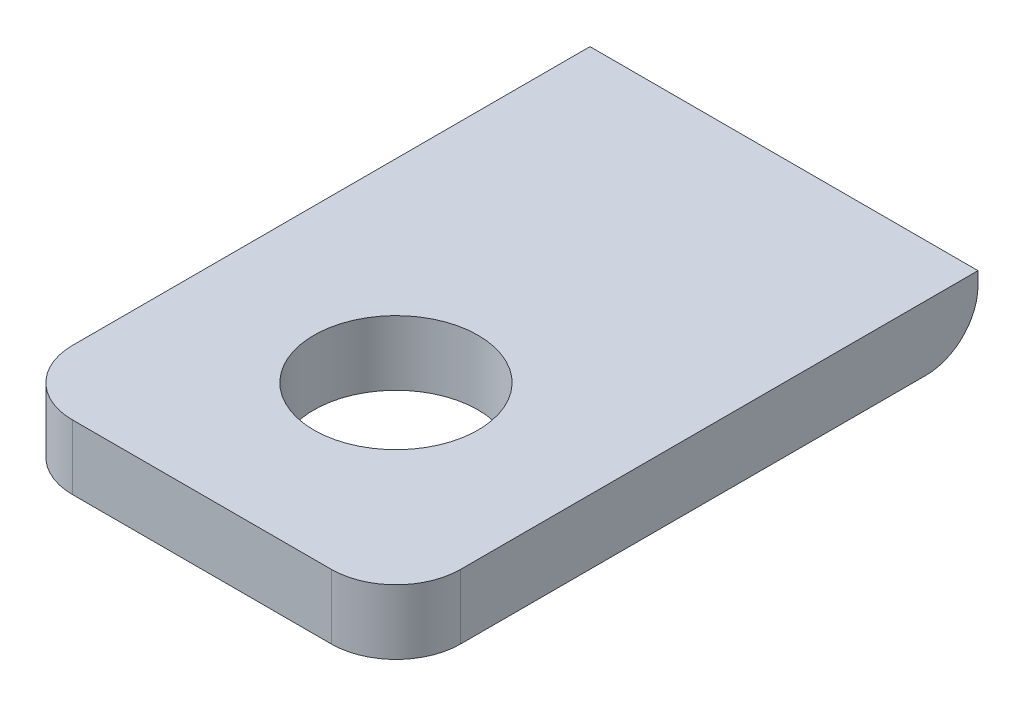
ISO-10303-21;
HEADER;
FILE_DESCRIPTION(('STEP AP214'),'2;1');
FILE_NAME('part.step','',(''),(''),'','','');
FILE_SCHEMA(('AUTOMOTIVE_DESIGN { 1 0 10303 214 1 1 1 1 }'));
ENDSEC;
DATA;
#1=APPLICATION_CONTEXT('core data for automotive mechanical design processes');
#2=APPLICATION_PROTOCOL_DEFINITION('international standard','automotive_design',2000,#1);
#3=PRODUCT_CONTEXT('',#1,'mechanical');
#4=PRODUCT('Part','Part','',(#3));
#5=PRODUCT_RELATED_PRODUCT_CATEGORY('part','',(#4));
#6=PRODUCT_DEFINITION_FORMATION('','',#4);
#7=PRODUCT_DEFINITION_CONTEXT('part definition',#1,'design');
#8=PRODUCT_DEFINITION('design','',#6,#7);
#9=PRODUCT_DEFINITION_SHAPE('','',#8);
#10=(LENGTH_UNIT() NAMED_UNIT(*) SI_UNIT(.MILLI.,.METRE.));
#11=(NAMED_UNIT(*) PLANE_ANGLE_UNIT() SI_UNIT($,.RADIAN.));
#12=(NAMED_UNIT(*) SI_UNIT($,.STERADIAN.) SOLID_ANGLE_UNIT());
#13=UNCERTAINTY_MEASURE_WITH_UNIT(LENGTH_MEASURE(1.E-05),#10,'distance_accuracy_value','');
#14=(GEOMETRIC_REPRESENTATION_CONTEXT(3) GLOBAL_UNCERTAINTY_ASSIGNED_CONTEXT((#13)) GLOBAL_UNIT_ASSIGNED_CONTEXT((#10,
#11,#12)) REPRESENTATION_CONTEXT('',''));
#15=CARTESIAN_POINT('',(0.,0.,0.));
#16=DIRECTION('',(0.,0.,1.));
#17=DIRECTION('',(1.,0.,0.));
#18=AXIS2_PLACEMENT_3D('',#15,#16,#17);
#19=CARTESIAN_POINT('',(8.55,0.1,3.95));
#20=DIRECTION('',(-1.,0.,0.));
#21=DIRECTION('',(0.,0.,1.));
#22=AXIS2_PLACEMENT_3D('',#19,#20,#21);
#23=CYLINDRICAL_SURFACE('',#22,0.2);
#24=CARTESIAN_POINT('',(10.05,0.1,3.95));
#25=DIRECTION('',(-1.,0.,0.));
#26=DIRECTION('',(0.,0.,1.));
#27=AXIS2_PLACEMENT_3D('',#24,#25,#26);
#28=CIRCLE('',#27,0.2);
#29=CARTESIAN_POINT('',(10.05,0.1,3.75));
#30=VERTEX_POINT('',#29);
#31=CARTESIAN_POINT('',(10.05,-0.1,3.95));
#32=VERTEX_POINT('',#31);
#33=EDGE_CURVE('E79',#30,#32,#28,.T.);
#34=ORIENTED_EDGE('',*,*,#33,.T.);
#35=DIRECTION('',(1.,0.,0.));
#36=VECTOR('',#35,1.);
#37=CARTESIAN_POINT('',(8.55,-0.1,3.95));
#38=LINE('',#37,#36);
#39=CARTESIAN_POINT('',(8.55,-0.1,3.95));
#40=VERTEX_POINT('',#39);
#41=EDGE_CURVE('E77',#40,#32,#38,.T.);
#42=ORIENTED_EDGE('',*,*,#41,.F.);
#43=CARTESIAN_POINT('',(8.55,0.1,3.95));
#44=DIRECTION('',(-1.,0.,0.));
#45=DIRECTION('',(0.,0.,1.));
#46=AXIS2_PLACEMENT_3D('',#43,#44,#45);
#47=CIRCLE('',#46,0.2);
#48=CARTESIAN_POINT('',(8.55,0.1,3.75));
#49=VERTEX_POINT('',#48);
#50=EDGE_CURVE('E21',#40,#49,#47,.F.);
#51=ORIENTED_EDGE('',*,*,#50,.T.);
#52=DIRECTION('',(-1.,0.,0.));
#53=VECTOR('',#52,1.);
#54=CARTESIAN_POINT('',(10.05,0.1,3.75));
#55=LINE('',#54,#53);
#56=EDGE_CURVE('E74',#30,#49,#55,.T.);
#57=ORIENTED_EDGE('',*,*,#56,.F.);
#58=EDGE_LOOP('',(#34,#42,#51,#57));
#59=FACE_BOUND('',#58,.T.);
#60=ADVANCED_FACE('F18',(#59),#23,.T.);
#61=CARTESIAN_POINT('',(8.55,-0.1,6.));
#62=DIRECTION('',(0.,-1.,0.));
#63=DIRECTION('',(0.,0.,-1.));
#64=AXIS2_PLACEMENT_3D('',#61,#62,#63);
#65=PLANE('',#64);
#66=CARTESIAN_POINT('',(9.3,-0.1,5.25));
#67=DIRECTION('',(0.,1.,0.));
#68=DIRECTION('',(0.,0.,1.));
#69=AXIS2_PLACEMENT_3D('',#66,#67,#68);
#70=CIRCLE('',#69,0.317499999999999);
#71=CARTESIAN_POINT('',(9.3,-0.1,5.5675));
#72=VERTEX_POINT('',#71);
#73=EDGE_CURVE('E101',#72,#72,#70,.T.);
#74=ORIENTED_EDGE('',*,*,#73,.T.);
#75=EDGE_LOOP('',(#74));
#76=FACE_BOUND('',#75,.T.);
#77=DIRECTION('',(1.,0.,0.));
#78=VECTOR('',#77,1.);
#79=CARTESIAN_POINT('',(10.05,-0.1,6.));
#80=LINE('',#79,#78);
#81=CARTESIAN_POINT('',(8.8,-0.1,6.));
#82=VERTEX_POINT('',#81);
#83=CARTESIAN_POINT('',(9.8,-0.1,6.));
#84=VERTEX_POINT('',#83);
#85=EDGE_CURVE('E109',#82,#84,#80,.T.);
#86=ORIENTED_EDGE('',*,*,#85,.F.);
#87=CARTESIAN_POINT('',(8.8,-0.1,5.75));
#88=DIRECTION('',(0.,1.,0.));
#89=DIRECTION('',(0.,0.,1.));
#90=AXIS2_PLACEMENT_3D('',#87,#88,#89);
#91=CIRCLE('',#90,0.25);
#92=CARTESIAN_POINT('',(8.55,-0.1,5.75));
#93=VERTEX_POINT('',#92);
#94=EDGE_CURVE('E94',#93,#82,#91,.T.);
#95=ORIENTED_EDGE('',*,*,#94,.F.);
#96=DIRECTION('',(0.,0.,1.));
#97=VECTOR('',#96,1.);
#98=CARTESIAN_POINT('',(8.55,-0.1,6.));
#99=LINE('',#98,#97);
#100=EDGE_CURVE('E90',#40,#93,#99,.T.);
#101=ORIENTED_EDGE('',*,*,#100,.F.);
#102=ORIENTED_EDGE('',*,*,#41,.T.);
#103=DIRECTION('',(0.,0.,-1.));
#104=VECTOR('',#103,1.);
#105=CARTESIAN_POINT('',(10.05,-0.1,3.75));
#106=LINE('',#105,#104);
#107=CARTESIAN_POINT('',(10.05,-0.1,5.75));
#108=VERTEX_POINT('',#107);
#109=EDGE_CURVE('E87',#108,#32,#106,.T.);
#110=ORIENTED_EDGE('',*,*,#109,.F.);
#111=CARTESIAN_POINT('',(9.8,-0.1,5.75));
#112=DIRECTION('',(0.,1.,0.));
#113=DIRECTION('',(0.,0.,1.));
#114=AXIS2_PLACEMENT_3D('',#111,#112,#113);
#115=CIRCLE('',#114,0.25);
#116=EDGE_CURVE('E112',#84,#108,#115,.T.);
#117=ORIENTED_EDGE('',*,*,#116,.F.);
#118=EDGE_LOOP('',(#86,#95,#101,#102,#110,#117));
#119=FACE_BOUND('',#118,.T.);
#120=ADVANCED_FACE('F134',(#76,#119),#65,.T.);
#121=CARTESIAN_POINT('',(10.05,0.15,3.75));
#122=DIRECTION('',(0.,0.,-1.));
#123=DIRECTION('',(-1.,0.,0.));
#124=AXIS2_PLACEMENT_3D('',#121,#122,#123);
#125=PLANE('',#124);
#126=DIRECTION('',(0.,1.,0.));
#127=VECTOR('',#126,1.);
#128=CARTESIAN_POINT('',(8.55,0.15,3.75));
#129=LINE('',#128,#127);
#130=CARTESIAN_POINT('',(8.55,0.15,3.75));
#131=VERTEX_POINT('',#130);
#132=EDGE_CURVE('E84',#131,#49,#129,.F.);
#133=ORIENTED_EDGE('',*,*,#132,.F.);
#134=DIRECTION('',(1.,0.,0.));
#135=VECTOR('',#134,1.);
#136=CARTESIAN_POINT('',(8.55,0.15,3.75));
#137=LINE('',#136,#135);
#138=CARTESIAN_POINT('',(10.05,0.15,3.75));
#139=VERTEX_POINT('',#138);
#140=EDGE_CURVE('E102',#131,#139,#137,.T.);
#141=ORIENTED_EDGE('',*,*,#140,.T.);
#142=DIRECTION('',(0.,1.,0.));
#143=VECTOR('',#142,1.);
#144=CARTESIAN_POINT('',(10.05,0.15,3.75));
#145=LINE('',#144,#143);
#146=EDGE_CURVE('E86',#30,#139,#145,.T.);
#147=ORIENTED_EDGE('',*,*,#146,.F.);
#148=ORIENTED_EDGE('',*,*,#56,.T.);
#149=EDGE_LOOP('',(#133,#141,#147,#148));
#150=FACE_BOUND('',#149,.T.);
#151=ADVANCED_FACE('F82',(#150),#125,.T.);
#152=CARTESIAN_POINT('',(10.05,0.15,3.75));
#153=DIRECTION('',(1.,0.,0.));
#154=DIRECTION('',(0.,0.,-1.));
#155=AXIS2_PLACEMENT_3D('',#152,#153,#154);
#156=PLANE('',#155);
#157=DIRECTION('',(0.,0.,-1.));
#158=VECTOR('',#157,1.);
#159=CARTESIAN_POINT('',(10.05,0.15,6.));
#160=LINE('',#159,#158);
#161=CARTESIAN_POINT('',(10.05,0.15,5.75));
#162=VERTEX_POINT('',#161);
#163=EDGE_CURVE('E104',#139,#162,#160,.F.);
#164=ORIENTED_EDGE('',*,*,#163,.T.);
#165=DIRECTION('',(0.,1.,0.));
#166=VECTOR('',#165,1.);
#167=CARTESIAN_POINT('',(10.05,0.15,5.75));
#168=LINE('',#167,#166);
#169=EDGE_CURVE('E110',#108,#162,#168,.T.);
#170=ORIENTED_EDGE('',*,*,#169,.F.);
#171=ORIENTED_EDGE('',*,*,#109,.T.);
#172=ORIENTED_EDGE('',*,*,#33,.F.);
#173=ORIENTED_EDGE('',*,*,#146,.T.);
#174=EDGE_LOOP('',(#164,#170,#171,#172,#173));
#175=FACE_BOUND('',#174,.T.);
#176=ADVANCED_FACE('F139',(#175),#156,.T.);
#177=CARTESIAN_POINT('',(9.8,0.15,5.75));
#178=DIRECTION('',(0.,1.,0.));
#179=DIRECTION('',(0.,0.,1.));
#180=AXIS2_PLACEMENT_3D('',#177,#178,#179);
#181=CYLINDRICAL_SURFACE('',#180,0.25);
#182=ORIENTED_EDGE('',*,*,#116,.T.);
#183=ORIENTED_EDGE('',*,*,#169,.T.);
#184=CARTESIAN_POINT('',(9.8,0.15,5.75));
#185=DIRECTION('',(0.,1.,0.));
#186=DIRECTION('',(0.,0.,1.));
#187=AXIS2_PLACEMENT_3D('',#184,#185,#186);
#188=CIRCLE('',#187,0.25);
#189=CARTESIAN_POINT('',(9.8,0.15,6.));
#190=VERTEX_POINT('',#189);
#191=EDGE_CURVE('E124',#162,#190,#188,.F.);
#192=ORIENTED_EDGE('',*,*,#191,.T.);
#193=DIRECTION('',(0.,1.,0.));
#194=VECTOR('',#193,1.);
#195=CARTESIAN_POINT('',(9.8,0.15,6.));
#196=LINE('',#195,#194);
#197=EDGE_CURVE('E107',#84,#190,#196,.T.);
#198=ORIENTED_EDGE('',*,*,#197,.F.);
#199=EDGE_LOOP('',(#182,#183,#192,#198));
#200=FACE_BOUND('',#199,.T.);
#201=ADVANCED_FACE('F143',(#200),#181,.T.);
#202=CARTESIAN_POINT('',(10.05,0.15,6.));
#203=DIRECTION('',(0.,0.,1.));
#204=DIRECTION('',(1.,0.,0.));
#205=AXIS2_PLACEMENT_3D('',#202,#203,#204);
#206=PLANE('',#205);
#207=ORIENTED_EDGE('',*,*,#85,.T.);
#208=ORIENTED_EDGE('',*,*,#197,.T.);
#209=DIRECTION('',(1.,0.,0.));
#210=VECTOR('',#209,1.);
#211=CARTESIAN_POINT('',(8.55,0.15,6.));
#212=LINE('',#211,#210);
#213=CARTESIAN_POINT('',(8.8,0.15,6.));
#214=VERTEX_POINT('',#213);
#215=EDGE_CURVE('E123',#190,#214,#212,.F.);
#216=ORIENTED_EDGE('',*,*,#215,.T.);
#217=DIRECTION('',(0.,1.,0.));
#218=VECTOR('',#217,1.);
#219=CARTESIAN_POINT('',(8.8,0.15,6.));
#220=LINE('',#219,#218);
#221=EDGE_CURVE('E91',#82,#214,#220,.T.);
#222=ORIENTED_EDGE('',*,*,#221,.F.);
#223=EDGE_LOOP('',(#207,#208,#216,#222));
#224=FACE_BOUND('',#223,.T.);
#225=ADVANCED_FACE('F159',(#224),#206,.T.);
#226=CARTESIAN_POINT('',(8.8,0.15,5.75));
#227=DIRECTION('',(0.,1.,0.));
#228=DIRECTION('',(0.,0.,1.));
#229=AXIS2_PLACEMENT_3D('',#226,#227,#228);
#230=CYLINDRICAL_SURFACE('',#229,0.25);
#231=ORIENTED_EDGE('',*,*,#94,.T.);
#232=ORIENTED_EDGE('',*,*,#221,.T.);
#233=CARTESIAN_POINT('',(8.8,0.15,5.75));
#234=DIRECTION('',(0.,1.,0.));
#235=DIRECTION('',(0.,0.,1.));
#236=AXIS2_PLACEMENT_3D('',#233,#234,#235);
#237=CIRCLE('',#236,0.25);
#238=CARTESIAN_POINT('',(8.55,0.15,5.75));
#239=VERTEX_POINT('',#238);
#240=EDGE_CURVE('E120',#214,#239,#237,.F.);
#241=ORIENTED_EDGE('',*,*,#240,.T.);
#242=DIRECTION('',(0.,1.,0.));
#243=VECTOR('',#242,1.);
#244=CARTESIAN_POINT('',(8.55,0.15,5.75));
#245=LINE('',#244,#243);
#246=EDGE_CURVE('E36',#93,#239,#245,.T.);
#247=ORIENTED_EDGE('',*,*,#246,.F.);
#248=EDGE_LOOP('',(#231,#232,#241,#247));
#249=FACE_BOUND('',#248,.T.);
#250=ADVANCED_FACE('F161',(#249),#230,.T.);
#251=CARTESIAN_POINT('',(8.55,0.15,6.));
#252=DIRECTION('',(-1.,0.,0.));
#253=DIRECTION('',(0.,0.,1.));
#254=AXIS2_PLACEMENT_3D('',#251,#252,#253);
#255=PLANE('',#254);
#256=ORIENTED_EDGE('',*,*,#246,.T.);
#257=DIRECTION('',(0.,0.,-1.));
#258=VECTOR('',#257,1.);
#259=CARTESIAN_POINT('',(8.55,0.15,6.));
#260=LINE('',#259,#258);
#261=EDGE_CURVE('E27',#239,#131,#260,.T.);
#262=ORIENTED_EDGE('',*,*,#261,.T.);
#263=ORIENTED_EDGE('',*,*,#132,.T.);
#264=ORIENTED_EDGE('',*,*,#50,.F.);
#265=ORIENTED_EDGE('',*,*,#100,.T.);
#266=EDGE_LOOP('',(#256,#262,#263,#264,#265));
#267=FACE_BOUND('',#266,.T.);
#268=ADVANCED_FACE('F89',(#267),#255,.T.);
#269=CARTESIAN_POINT('',(9.3,5.,5.25));
#270=DIRECTION('',(0.,1.,0.));
#271=DIRECTION('',(0.,0.,1.));
#272=AXIS2_PLACEMENT_3D('',#269,#270,#271);
#273=CYLINDRICAL_SURFACE('',#272,0.317499999999999);
#274=ORIENTED_EDGE('',*,*,#73,.F.);
#275=EDGE_LOOP('',(#274));
#276=FACE_BOUND('',#275,.T.);
#277=CARTESIAN_POINT('',(9.3,0.15,5.25));
#278=DIRECTION('',(0.,1.,0.));
#279=DIRECTION('',(0.,0.,1.));
#280=AXIS2_PLACEMENT_3D('',#277,#278,#279);
#281=CIRCLE('',#280,0.317499999999999);
#282=CARTESIAN_POINT('',(9.3,0.15,5.5675));
#283=VERTEX_POINT('',#282);
#284=EDGE_CURVE('E11',#283,#283,#281,.T.);
#285=ORIENTED_EDGE('',*,*,#284,.T.);
#286=EDGE_LOOP('',(#285));
#287=FACE_BOUND('',#286,.T.);
#288=ADVANCED_FACE('F169',(#276,#287),#273,.F.);
#289=CARTESIAN_POINT('',(8.55,0.15,6.));
#290=DIRECTION('',(0.,-1.,0.));
#291=DIRECTION('',(0.,0.,-1.));
#292=AXIS2_PLACEMENT_3D('',#289,#290,#291);
#293=PLANE('',#292);
#294=ORIENTED_EDGE('',*,*,#284,.F.);
#295=EDGE_LOOP('',(#294));
#296=FACE_BOUND('',#295,.T.);
#297=ORIENTED_EDGE('',*,*,#240,.F.);
#298=ORIENTED_EDGE('',*,*,#215,.F.);
#299=ORIENTED_EDGE('',*,*,#191,.F.);
#300=ORIENTED_EDGE('',*,*,#163,.F.);
#301=ORIENTED_EDGE('',*,*,#140,.F.);
#302=ORIENTED_EDGE('',*,*,#261,.F.);
#303=EDGE_LOOP('',(#297,#298,#299,#300,#301,#302));
#304=FACE_BOUND('',#303,.T.);
#305=ADVANCED_FACE('F148',(#296,#304),#293,.F.);
#306=CLOSED_SHELL('',(#60,#120,#151,#176,#201,#225,#250,#268,#288,#305));
#307=MANIFOLD_SOLID_BREP('B1',#306);
#308=ADVANCED_BREP_SHAPE_REPRESENTATION('',(#18,#307),#14);
#309=SHAPE_DEFINITION_REPRESENTATION(#9,#308);
ENDSEC;
END-ISO-10303-21;
